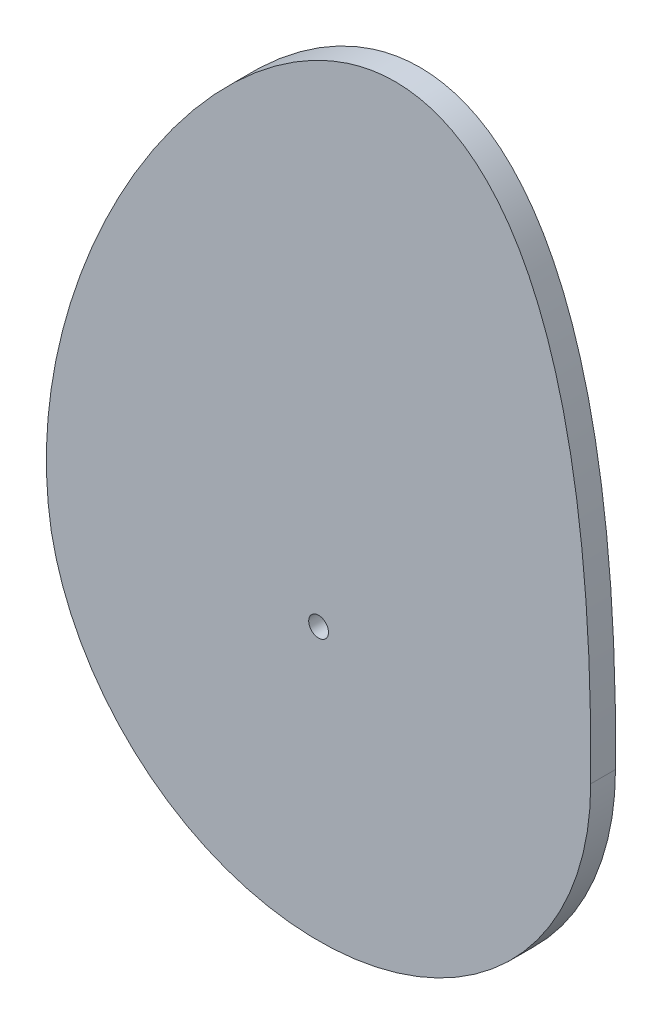
ISO-10303-21;
HEADER;
FILE_DESCRIPTION(('STEP AP214'),'2;1');
FILE_NAME('part.step','',(''),(''),'','','');
FILE_SCHEMA(('AUTOMOTIVE_DESIGN { 1 0 10303 214 1 1 1 1 }'));
ENDSEC;
DATA;
#1=APPLICATION_CONTEXT('core data for automotive mechanical design processes');
#2=APPLICATION_PROTOCOL_DEFINITION('international standard','automotive_design',2000,#1);
#3=PRODUCT_CONTEXT('',#1,'mechanical');
#4=PRODUCT('Part','Part','',(#3));
#5=PRODUCT_RELATED_PRODUCT_CATEGORY('part','',(#4));
#6=PRODUCT_DEFINITION_FORMATION('','',#4);
#7=PRODUCT_DEFINITION_CONTEXT('part definition',#1,'design');
#8=PRODUCT_DEFINITION('design','',#6,#7);
#9=PRODUCT_DEFINITION_SHAPE('','',#8);
#10=(LENGTH_UNIT() NAMED_UNIT(*) SI_UNIT(.MILLI.,.METRE.));
#11=(NAMED_UNIT(*) PLANE_ANGLE_UNIT() SI_UNIT($,.RADIAN.));
#12=(NAMED_UNIT(*) SI_UNIT($,.STERADIAN.) SOLID_ANGLE_UNIT());
#13=UNCERTAINTY_MEASURE_WITH_UNIT(LENGTH_MEASURE(1.E-05),#10,'distance_accuracy_value','');
#14=(GEOMETRIC_REPRESENTATION_CONTEXT(3) GLOBAL_UNCERTAINTY_ASSIGNED_CONTEXT((#13)) GLOBAL_UNIT_ASSIGNED_CONTEXT((#10,
#11,#12)) REPRESENTATION_CONTEXT('',''));
#15=CARTESIAN_POINT('',(0.,0.,0.));
#16=DIRECTION('',(0.,0.,1.));
#17=DIRECTION('',(1.,0.,0.));
#18=AXIS2_PLACEMENT_3D('',#15,#16,#17);
#19=CARTESIAN_POINT('',(55.,0.,5.));
#20=CARTESIAN_POINT('',(56.7618837579365,195.857792894587,5.));
#21=CARTESIAN_POINT('',(-67.173590813337,66.3980857840583,5.));
#22=CARTESIAN_POINT('',(-54.0443255913219,-10.2083726116941,5.));
#23=B_SPLINE_CURVE_WITH_KNOTS('',3,(#19,#20,#21,#22),.UNSPECIFIED.,.F.,.F.,(4,4),(0.,1.),.UNSPECIFIED.);
#24=DIRECTION('',(0.,0.,-1.));
#25=VECTOR('',#24,1.);
#26=SURFACE_OF_LINEAR_EXTRUSION('',#23,#25);
#27=CARTESIAN_POINT('',(55.,0.,0.));
#28=CARTESIAN_POINT('',(56.7618837579365,195.857792894587,0.));
#29=CARTESIAN_POINT('',(-67.173590813337,66.3980857840583,0.));
#30=CARTESIAN_POINT('',(-54.0443255913219,-10.2083726116941,0.));
#31=B_SPLINE_CURVE_WITH_KNOTS('',3,(#27,#28,#29,#30),.UNSPECIFIED.,.F.,.F.,(4,4),(0.,1.),.UNSPECIFIED.);
#32=CARTESIAN_POINT('',(55.,0.,0.));
#33=VERTEX_POINT('',#32);
#34=CARTESIAN_POINT('',(-54.0443255913219,-10.2083726116941,0.));
#35=VERTEX_POINT('',#34);
#36=EDGE_CURVE('E75',#33,#35,#31,.T.);
#37=ORIENTED_EDGE('',*,*,#36,.T.);
#38=DIRECTION('',(0.,0.,-1.));
#39=VECTOR('',#38,1.);
#40=CARTESIAN_POINT('',(-54.0443255913219,-10.2083726116941,5.));
#41=LINE('',#40,#39);
#42=CARTESIAN_POINT('',(-54.0443255913219,-10.2083726116941,5.));
#43=VERTEX_POINT('',#42);
#44=EDGE_CURVE('E11',#43,#35,#41,.T.);
#45=ORIENTED_EDGE('',*,*,#44,.F.);
#46=CARTESIAN_POINT('',(55.,0.,5.));
#47=VERTEX_POINT('',#46);
#48=EDGE_CURVE('E78',#47,#43,#23,.T.);
#49=ORIENTED_EDGE('',*,*,#48,.F.);
#50=DIRECTION('',(0.,0.,-1.));
#51=VECTOR('',#50,1.);
#52=CARTESIAN_POINT('',(55.,0.,5.));
#53=LINE('',#52,#51);
#54=EDGE_CURVE('E51',#47,#33,#53,.T.);
#55=ORIENTED_EDGE('',*,*,#54,.T.);
#56=EDGE_LOOP('',(#37,#45,#49,#55));
#57=FACE_BOUND('',#56,.T.);
#58=ADVANCED_FACE('F41',(#57),#26,.F.);
#59=CARTESIAN_POINT('',(0.,0.,5.));
#60=DIRECTION('',(0.,0.,-1.));
#61=DIRECTION('',(-1.,0.,0.));
#62=AXIS2_PLACEMENT_3D('',#59,#60,#61);
#63=CYLINDRICAL_SURFACE('',#62,55.);
#64=CARTESIAN_POINT('',(0.,0.,0.));
#65=DIRECTION('',(0.,0.,1.));
#66=DIRECTION('',(1.,0.,0.));
#67=AXIS2_PLACEMENT_3D('',#64,#65,#66);
#68=CIRCLE('',#67,55.);
#69=EDGE_CURVE('E66',#35,#33,#68,.T.);
#70=ORIENTED_EDGE('',*,*,#69,.T.);
#71=ORIENTED_EDGE('',*,*,#54,.F.);
#72=CARTESIAN_POINT('',(0.,0.,5.));
#73=DIRECTION('',(0.,0.,1.));
#74=DIRECTION('',(1.,0.,0.));
#75=AXIS2_PLACEMENT_3D('',#72,#73,#74);
#76=CIRCLE('',#75,55.);
#77=EDGE_CURVE('E58',#43,#47,#76,.T.);
#78=ORIENTED_EDGE('',*,*,#77,.F.);
#79=ORIENTED_EDGE('',*,*,#44,.T.);
#80=EDGE_LOOP('',(#70,#71,#78,#79));
#81=FACE_BOUND('',#80,.T.);
#82=ADVANCED_FACE('F69',(#81),#63,.T.);
#83=CARTESIAN_POINT('',(0.,0.,5.));
#84=DIRECTION('',(0.,0.,-1.));
#85=DIRECTION('',(-1.,0.,0.));
#86=AXIS2_PLACEMENT_3D('',#83,#84,#85);
#87=CYLINDRICAL_SURFACE('',#86,2.);
#88=CARTESIAN_POINT('',(0.,0.,5.));
#89=DIRECTION('',(0.,0.,1.));
#90=DIRECTION('',(1.,0.,0.));
#91=AXIS2_PLACEMENT_3D('',#88,#89,#90);
#92=CIRCLE('',#91,2.);
#93=CARTESIAN_POINT('',(2.,0.,5.));
#94=VERTEX_POINT('',#93);
#95=EDGE_CURVE('E80',#94,#94,#92,.T.);
#96=ORIENTED_EDGE('',*,*,#95,.T.);
#97=EDGE_LOOP('',(#96));
#98=FACE_BOUND('',#97,.T.);
#99=CARTESIAN_POINT('',(0.,0.,0.));
#100=DIRECTION('',(0.,0.,1.));
#101=DIRECTION('',(1.,0.,0.));
#102=AXIS2_PLACEMENT_3D('',#99,#100,#101);
#103=CIRCLE('',#102,2.);
#104=CARTESIAN_POINT('',(2.,0.,0.));
#105=VERTEX_POINT('',#104);
#106=EDGE_CURVE('E74',#105,#105,#103,.T.);
#107=ORIENTED_EDGE('',*,*,#106,.F.);
#108=EDGE_LOOP('',(#107));
#109=FACE_BOUND('',#108,.T.);
#110=ADVANCED_FACE('F108',(#98,#109),#87,.F.);
#111=CARTESIAN_POINT('',(0.,0.,5.));
#112=DIRECTION('',(0.,0.,1.));
#113=DIRECTION('',(1.,0.,0.));
#114=AXIS2_PLACEMENT_3D('',#111,#112,#113);
#115=PLANE('',#114);
#116=ORIENTED_EDGE('',*,*,#48,.T.);
#117=ORIENTED_EDGE('',*,*,#77,.T.);
#118=EDGE_LOOP('',(#116,#117));
#119=FACE_BOUND('',#118,.T.);
#120=ORIENTED_EDGE('',*,*,#95,.F.);
#121=EDGE_LOOP('',(#120));
#122=FACE_BOUND('',#121,.T.);
#123=ADVANCED_FACE('F111',(#119,#122),#115,.T.);
#124=CARTESIAN_POINT('',(0.,0.,0.));
#125=DIRECTION('',(0.,0.,1.));
#126=DIRECTION('',(1.,0.,0.));
#127=AXIS2_PLACEMENT_3D('',#124,#125,#126);
#128=PLANE('',#127);
#129=ORIENTED_EDGE('',*,*,#36,.F.);
#130=ORIENTED_EDGE('',*,*,#69,.F.);
#131=EDGE_LOOP('',(#129,#130));
#132=FACE_BOUND('',#131,.T.);
#133=ORIENTED_EDGE('',*,*,#106,.T.);
#134=EDGE_LOOP('',(#133));
#135=FACE_BOUND('',#134,.T.);
#136=ADVANCED_FACE('F81',(#132,#135),#128,.F.);
#137=CLOSED_SHELL('',(#58,#82,#110,#123,#136));
#138=MANIFOLD_SOLID_BREP('B2',#137);
#139=ADVANCED_BREP_SHAPE_REPRESENTATION('',(#18,#138),#14);
#140=SHAPE_DEFINITION_REPRESENTATION(#9,#139);
ENDSEC;
END-ISO-10303-21;
